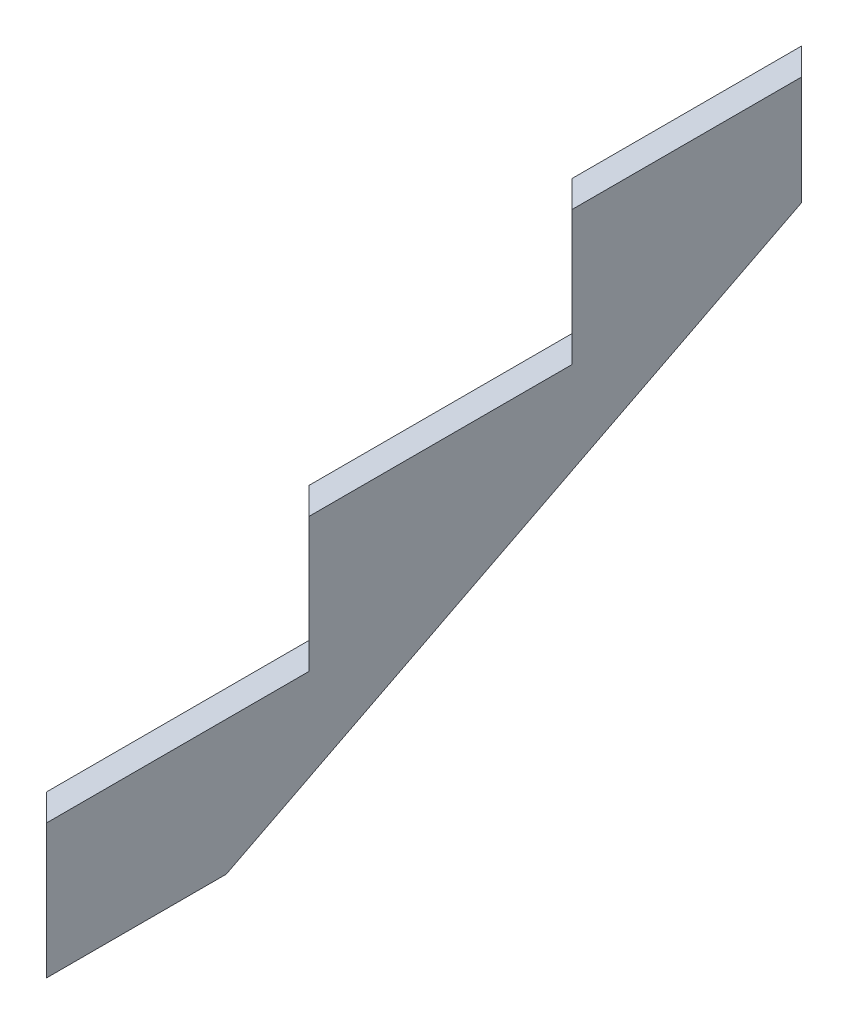
ISO-10303-21;
HEADER;
FILE_DESCRIPTION(('STEP AP214'),'2;1');
FILE_NAME('part.step','',(''),(''),'','','');
FILE_SCHEMA(('AUTOMOTIVE_DESIGN { 1 0 10303 214 1 1 1 1 }'));
ENDSEC;
DATA;
#1=APPLICATION_CONTEXT('core data for automotive mechanical design processes');
#2=APPLICATION_PROTOCOL_DEFINITION('international standard','automotive_design',2000,#1);
#3=PRODUCT_CONTEXT('',#1,'mechanical');
#4=PRODUCT('Part','Part','',(#3));
#5=PRODUCT_RELATED_PRODUCT_CATEGORY('part','',(#4));
#6=PRODUCT_DEFINITION_FORMATION('','',#4);
#7=PRODUCT_DEFINITION_CONTEXT('part definition',#1,'design');
#8=PRODUCT_DEFINITION('design','',#6,#7);
#9=PRODUCT_DEFINITION_SHAPE('','',#8);
#10=(LENGTH_UNIT() NAMED_UNIT(*) SI_UNIT(.MILLI.,.METRE.));
#11=(NAMED_UNIT(*) PLANE_ANGLE_UNIT() SI_UNIT($,.RADIAN.));
#12=(NAMED_UNIT(*) SI_UNIT($,.STERADIAN.) SOLID_ANGLE_UNIT());
#13=UNCERTAINTY_MEASURE_WITH_UNIT(LENGTH_MEASURE(1.E-05),#10,'distance_accuracy_value','');
#14=(GEOMETRIC_REPRESENTATION_CONTEXT(3) GLOBAL_UNCERTAINTY_ASSIGNED_CONTEXT((#13)) GLOBAL_UNIT_ASSIGNED_CONTEXT((#10,
#11,#12)) REPRESENTATION_CONTEXT('',''));
#15=CARTESIAN_POINT('',(0.,0.,0.));
#16=DIRECTION('',(0.,0.,1.));
#17=DIRECTION('',(1.,0.,0.));
#18=AXIS2_PLACEMENT_3D('',#15,#16,#17);
#19=CARTESIAN_POINT('',(38.1,0.,0.));
#20=DIRECTION('',(0.,1.,0.));
#21=DIRECTION('',(0.,0.,1.));
#22=AXIS2_PLACEMENT_3D('',#19,#20,#21);
#23=PLANE('',#22);
#24=DIRECTION('',(0.,0.,-1.));
#25=VECTOR('',#24,1.);
#26=CARTESIAN_POINT('',(38.1,0.,0.));
#27=LINE('',#26,#25);
#28=CARTESIAN_POINT('',(38.1,0.,0.));
#29=VERTEX_POINT('',#28);
#30=CARTESIAN_POINT('',(38.1,0.,-255.19928490216));
#31=VERTEX_POINT('',#30);
#32=EDGE_CURVE('E111',#29,#31,#27,.T.);
#33=ORIENTED_EDGE('',*,*,#32,.F.);
#34=DIRECTION('',(0.707106781186551,0.,0.707106781186544));
#35=VECTOR('',#34,1.);
#36=CARTESIAN_POINT('',(38.1,0.,0.));
#37=LINE('',#36,#35);
#38=CARTESIAN_POINT('',(0.,0.,-38.0999999999996));
#39=VERTEX_POINT('',#38);
#40=EDGE_CURVE('E107',#39,#29,#37,.T.);
#41=ORIENTED_EDGE('',*,*,#40,.F.);
#42=DIRECTION('',(0.,0.,-1.));
#43=VECTOR('',#42,1.);
#44=CARTESIAN_POINT('',(0.,0.,0.));
#45=LINE('',#44,#43);
#46=CARTESIAN_POINT('',(0.,0.,-255.19928490216));
#47=VERTEX_POINT('',#46);
#48=EDGE_CURVE('E128',#39,#47,#45,.T.);
#49=ORIENTED_EDGE('',*,*,#48,.T.);
#50=DIRECTION('',(-1.,0.,0.));
#51=VECTOR('',#50,1.);
#52=CARTESIAN_POINT('',(38.1,0.,-255.19928490216));
#53=LINE('',#52,#51);
#54=EDGE_CURVE('E11',#31,#47,#53,.T.);
#55=ORIENTED_EDGE('',*,*,#54,.F.);
#56=EDGE_LOOP('',(#33,#41,#49,#55));
#57=FACE_BOUND('',#56,.T.);
#58=ADVANCED_FACE('F35',(#57),#23,.F.);
#59=CARTESIAN_POINT('',(38.1,-103.395446885827,-52.8263162115477));
#60=DIRECTION('',(0.,0.890505333104577,0.454972803266642));
#61=DIRECTION('',(0.,-0.454972803266642,0.890505333104577));
#62=AXIS2_PLACEMENT_3D('',#59,#60,#61);
#63=PLANE('',#62);
#64=DIRECTION('',(0.,0.454972803266642,-0.890505333104577));
#65=VECTOR('',#64,1.);
#66=CARTESIAN_POINT('',(0.,-103.395446885827,-52.8263162115477));
#67=LINE('',#66,#65);
#68=CARTESIAN_POINT('',(0.,436.526629401535,-1109.6004463193));
#69=VERTEX_POINT('',#68);
#70=EDGE_CURVE('E130',#47,#69,#67,.T.);
#71=ORIENTED_EDGE('',*,*,#70,.T.);
#72=DIRECTION('',(-0.665037921925039,0.339778052268348,-0.665037921925024));
#73=VECTOR('',#72,1.);
#74=CARTESIAN_POINT('',(505.872214019945,178.068773225707,-603.728232299372));
#75=LINE('',#74,#73);
#76=CARTESIAN_POINT('',(38.0999999999998,417.060756306733,-1071.50044631931));
#77=VERTEX_POINT('',#76);
#78=EDGE_CURVE('E131',#77,#69,#75,.T.);
#79=ORIENTED_EDGE('',*,*,#78,.F.);
#80=DIRECTION('',(0.,0.454972803266642,-0.890505333104577));
#81=VECTOR('',#80,1.);
#82=CARTESIAN_POINT('',(38.1,-103.395446885827,-52.8263162115477));
#83=LINE('',#82,#81);
#84=EDGE_CURVE('E173',#31,#77,#83,.T.);
#85=ORIENTED_EDGE('',*,*,#84,.F.);
#86=ORIENTED_EDGE('',*,*,#54,.T.);
#87=EDGE_LOOP('',(#71,#79,#85,#86));
#88=FACE_BOUND('',#87,.T.);
#89=ADVANCED_FACE('F189',(#88),#63,.F.);
#90=CARTESIAN_POINT('',(38.1,571.5,0.));
#91=DIRECTION('',(0.,-1.,0.));
#92=DIRECTION('',(0.,0.,-1.));
#93=AXIS2_PLACEMENT_3D('',#90,#91,#92);
#94=PLANE('',#93);
#95=DIRECTION('',(0.,0.,1.));
#96=VECTOR('',#95,1.);
#97=CARTESIAN_POINT('',(0.,571.5,0.));
#98=LINE('',#97,#96);
#99=CARTESIAN_POINT('',(0.,571.5,-1109.6004463193));
#100=VERTEX_POINT('',#99);
#101=CARTESIAN_POINT('',(0.,571.5,-783.820468293582));
#102=VERTEX_POINT('',#101);
#103=EDGE_CURVE('E137',#100,#102,#98,.T.);
#104=ORIENTED_EDGE('',*,*,#103,.T.);
#105=DIRECTION('',(-0.707106781186551,0.,-0.707106781186544));
#106=VECTOR('',#105,1.);
#107=CARTESIAN_POINT('',(391.910234146791,571.5,-391.910234146795));
#108=LINE('',#107,#106);
#109=CARTESIAN_POINT('',(38.1,571.5,-745.720468293582));
#110=VERTEX_POINT('',#109);
#111=EDGE_CURVE('E162',#110,#102,#108,.T.);
#112=ORIENTED_EDGE('',*,*,#111,.F.);
#113=DIRECTION('',(0.,0.,1.));
#114=VECTOR('',#113,1.);
#115=CARTESIAN_POINT('',(38.1,571.5,0.));
#116=LINE('',#115,#114);
#117=CARTESIAN_POINT('',(38.1,571.5,-1071.50044631931));
#118=VERTEX_POINT('',#117);
#119=EDGE_CURVE('E176',#118,#110,#116,.T.);
#120=ORIENTED_EDGE('',*,*,#119,.F.);
#121=DIRECTION('',(0.707106781186556,0.,0.707106781186539));
#122=VECTOR('',#121,1.);
#123=CARTESIAN_POINT('',(554.800223159652,571.5,-554.800223159665));
#124=LINE('',#123,#122);
#125=EDGE_CURVE('E158',#100,#118,#124,.T.);
#126=ORIENTED_EDGE('',*,*,#125,.F.);
#127=EDGE_LOOP('',(#104,#112,#120,#126));
#128=FACE_BOUND('',#127,.T.);
#129=ADVANCED_FACE('F182',(#128),#94,.F.);
#130=CARTESIAN_POINT('',(38.1,381.,-1.13445986899117E-13));
#131=DIRECTION('',(0.,1.,0.));
#132=DIRECTION('',(0.,0.,1.));
#133=AXIS2_PLACEMENT_3D('',#130,#131,#132);
#134=PLANE('',#133);
#135=DIRECTION('',(-0.707106781186551,0.,-0.707106781186544));
#136=VECTOR('',#135,1.);
#137=CARTESIAN_POINT('',(38.1,381.,-372.860234146791));
#138=LINE('',#137,#136);
#139=CARTESIAN_POINT('',(38.1,381.,-372.860234146791));
#140=VERTEX_POINT('',#139);
#141=CARTESIAN_POINT('',(0.,381.,-410.960234146791));
#142=VERTEX_POINT('',#141);
#143=EDGE_CURVE('E193',#140,#142,#138,.T.);
#144=ORIENTED_EDGE('',*,*,#143,.F.);
#145=DIRECTION('',(0.,0.,-1.));
#146=VECTOR('',#145,1.);
#147=CARTESIAN_POINT('',(38.1,381.,-1.13445986899117E-13));
#148=LINE('',#147,#146);
#149=CARTESIAN_POINT('',(38.1,381.,-745.720468293583));
#150=VERTEX_POINT('',#149);
#151=EDGE_CURVE('E124',#140,#150,#148,.T.);
#152=ORIENTED_EDGE('',*,*,#151,.T.);
#153=DIRECTION('',(0.707106781186551,0.,0.707106781186544));
#154=VECTOR('',#153,1.);
#155=CARTESIAN_POINT('',(391.910234146791,381.,-391.910234146795));
#156=LINE('',#155,#154);
#157=CARTESIAN_POINT('',(0.,381.,-783.820468293582));
#158=VERTEX_POINT('',#157);
#159=EDGE_CURVE('E154',#158,#150,#156,.T.);
#160=ORIENTED_EDGE('',*,*,#159,.F.);
#161=DIRECTION('',(0.,0.,-1.));
#162=VECTOR('',#161,1.);
#163=CARTESIAN_POINT('',(0.,381.,-1.13445986899117E-13));
#164=LINE('',#163,#162);
#165=EDGE_CURVE('E140',#142,#158,#164,.T.);
#166=ORIENTED_EDGE('',*,*,#165,.F.);
#167=EDGE_LOOP('',(#144,#152,#160,#166));
#168=FACE_BOUND('',#167,.T.);
#169=ADVANCED_FACE('F155',(#168),#134,.T.);
#170=CARTESIAN_POINT('',(38.1,190.5,0.));
#171=DIRECTION('',(0.,1.,0.));
#172=DIRECTION('',(0.,0.,1.));
#173=AXIS2_PLACEMENT_3D('',#170,#171,#172);
#174=PLANE('',#173);
#175=DIRECTION('',(-0.707106781186551,0.,-0.707106781186544));
#176=VECTOR('',#175,1.);
#177=CARTESIAN_POINT('',(38.1,190.5,0.));
#178=LINE('',#177,#176);
#179=CARTESIAN_POINT('',(38.1,190.5,0.));
#180=VERTEX_POINT('',#179);
#181=CARTESIAN_POINT('',(0.,190.5,-38.0999999999996));
#182=VERTEX_POINT('',#181);
#183=EDGE_CURVE('E49',#180,#182,#178,.T.);
#184=ORIENTED_EDGE('',*,*,#183,.F.);
#185=DIRECTION('',(0.,0.,-1.));
#186=VECTOR('',#185,1.);
#187=CARTESIAN_POINT('',(38.1,190.5,0.));
#188=LINE('',#187,#186);
#189=CARTESIAN_POINT('',(38.1,190.5,-372.860234146791));
#190=VERTEX_POINT('',#189);
#191=EDGE_CURVE('E42',#180,#190,#188,.T.);
#192=ORIENTED_EDGE('',*,*,#191,.T.);
#193=DIRECTION('',(0.707106781186551,0.,0.707106781186544));
#194=VECTOR('',#193,1.);
#195=CARTESIAN_POINT('',(38.1,190.5,-372.860234146791));
#196=LINE('',#195,#194);
#197=CARTESIAN_POINT('',(0.,190.5,-410.960234146791));
#198=VERTEX_POINT('',#197);
#199=EDGE_CURVE('E164',#198,#190,#196,.T.);
#200=ORIENTED_EDGE('',*,*,#199,.F.);
#201=DIRECTION('',(0.,0.,-1.));
#202=VECTOR('',#201,1.);
#203=CARTESIAN_POINT('',(0.,190.5,0.));
#204=LINE('',#203,#202);
#205=EDGE_CURVE('E56',#182,#198,#204,.T.);
#206=ORIENTED_EDGE('',*,*,#205,.F.);
#207=EDGE_LOOP('',(#184,#192,#200,#206));
#208=FACE_BOUND('',#207,.T.);
#209=ADVANCED_FACE('F115',(#208),#174,.T.);
#210=CARTESIAN_POINT('',(38.1,0.,0.));
#211=DIRECTION('',(1.,0.,0.));
#212=DIRECTION('',(0.,0.,-1.));
#213=AXIS2_PLACEMENT_3D('',#210,#211,#212);
#214=PLANE('',#213);
#215=DIRECTION('',(0.,1.,0.));
#216=VECTOR('',#215,1.);
#217=CARTESIAN_POINT('',(38.1,369.599575789148,-1071.50044631931));
#218=LINE('',#217,#216);
#219=EDGE_CURVE('E169',#77,#118,#218,.T.);
#220=ORIENTED_EDGE('',*,*,#219,.T.);
#221=ORIENTED_EDGE('',*,*,#119,.T.);
#222=DIRECTION('',(0.,1.,0.));
#223=VECTOR('',#222,1.);
#224=CARTESIAN_POINT('',(38.1,4.34601592563669E-13,-745.720468293583));
#225=LINE('',#224,#223);
#226=EDGE_CURVE('E179',#150,#110,#225,.T.);
#227=ORIENTED_EDGE('',*,*,#226,.F.);
#228=ORIENTED_EDGE('',*,*,#151,.F.);
#229=DIRECTION('',(0.,1.,0.));
#230=VECTOR('',#229,1.);
#231=CARTESIAN_POINT('',(38.1,0.,-372.860234146791));
#232=LINE('',#231,#230);
#233=EDGE_CURVE('E122',#190,#140,#232,.T.);
#234=ORIENTED_EDGE('',*,*,#233,.F.);
#235=ORIENTED_EDGE('',*,*,#191,.F.);
#236=DIRECTION('',(0.,1.,0.));
#237=VECTOR('',#236,1.);
#238=CARTESIAN_POINT('',(38.1,0.,0.));
#239=LINE('',#238,#237);
#240=EDGE_CURVE('E104',#29,#180,#239,.T.);
#241=ORIENTED_EDGE('',*,*,#240,.F.);
#242=ORIENTED_EDGE('',*,*,#32,.T.);
#243=ORIENTED_EDGE('',*,*,#84,.T.);
#244=EDGE_LOOP('',(#220,#221,#227,#228,#234,#235,#241,#242,#243));
#245=FACE_BOUND('',#244,.T.);
#246=ADVANCED_FACE('F120',(#245),#214,.T.);
#247=CARTESIAN_POINT('',(0.,0.,0.));
#248=DIRECTION('',(1.,0.,0.));
#249=DIRECTION('',(0.,0.,-1.));
#250=AXIS2_PLACEMENT_3D('',#247,#248,#249);
#251=PLANE('',#250);
#252=ORIENTED_EDGE('',*,*,#48,.F.);
#253=DIRECTION('',(0.,1.,0.));
#254=VECTOR('',#253,1.);
#255=CARTESIAN_POINT('',(0.,-53.8815367264146,-38.0999999999996));
#256=LINE('',#255,#254);
#257=EDGE_CURVE('E116',#39,#182,#256,.T.);
#258=ORIENTED_EDGE('',*,*,#257,.T.);
#259=ORIENTED_EDGE('',*,*,#205,.T.);
#260=DIRECTION('',(0.,1.,0.));
#261=VECTOR('',#260,1.);
#262=CARTESIAN_POINT('',(0.,136.618463273585,-410.960234146791));
#263=LINE('',#262,#261);
#264=EDGE_CURVE('E150',#198,#142,#263,.T.);
#265=ORIENTED_EDGE('',*,*,#264,.T.);
#266=ORIENTED_EDGE('',*,*,#165,.T.);
#267=DIRECTION('',(0.,1.,0.));
#268=VECTOR('',#267,1.);
#269=CARTESIAN_POINT('',(0.,327.118463273585,-783.820468293582));
#270=LINE('',#269,#268);
#271=EDGE_CURVE('E148',#158,#102,#270,.T.);
#272=ORIENTED_EDGE('',*,*,#271,.T.);
#273=ORIENTED_EDGE('',*,*,#103,.F.);
#274=DIRECTION('',(0.,-1.,0.));
#275=VECTOR('',#274,1.);
#276=CARTESIAN_POINT('',(0.,0.,-1109.6004463193));
#277=LINE('',#276,#275);
#278=EDGE_CURVE('E134',#100,#69,#277,.T.);
#279=ORIENTED_EDGE('',*,*,#278,.T.);
#280=ORIENTED_EDGE('',*,*,#70,.F.);
#281=EDGE_LOOP('',(#252,#258,#259,#265,#266,#272,#273,#279,#280));
#282=FACE_BOUND('',#281,.T.);
#283=ADVANCED_FACE('F145',(#282),#251,.F.);
#284=CARTESIAN_POINT('',(554.800223159652,369.599575789148,-554.800223159665));
#285=DIRECTION('',(-0.70710678118654,0.,0.707106781186556));
#286=DIRECTION('',(0.707106781186556,0.,0.707106781186539));
#287=AXIS2_PLACEMENT_3D('',#284,#285,#286);
#288=PLANE('',#287);
#289=ORIENTED_EDGE('',*,*,#78,.T.);
#290=ORIENTED_EDGE('',*,*,#278,.F.);
#291=ORIENTED_EDGE('',*,*,#125,.T.);
#292=ORIENTED_EDGE('',*,*,#219,.F.);
#293=EDGE_LOOP('',(#289,#290,#291,#292));
#294=FACE_BOUND('',#293,.T.);
#295=ADVANCED_FACE('F187',(#294),#288,.F.);
#296=CARTESIAN_POINT('',(391.910234146791,327.118463273585,-391.910234146795));
#297=DIRECTION('',(0.707106781186544,0.,-0.707106781186551));
#298=DIRECTION('',(-0.707106781186551,0.,-0.707106781186544));
#299=AXIS2_PLACEMENT_3D('',#296,#297,#298);
#300=PLANE('',#299);
#301=ORIENTED_EDGE('',*,*,#159,.T.);
#302=ORIENTED_EDGE('',*,*,#226,.T.);
#303=ORIENTED_EDGE('',*,*,#111,.T.);
#304=ORIENTED_EDGE('',*,*,#271,.F.);
#305=EDGE_LOOP('',(#301,#302,#303,#304));
#306=FACE_BOUND('',#305,.T.);
#307=ADVANCED_FACE('F160',(#306),#300,.F.);
#308=CARTESIAN_POINT('',(38.1,136.618463273585,-372.860234146791));
#309=DIRECTION('',(0.707106781186544,0.,-0.707106781186551));
#310=DIRECTION('',(-0.707106781186551,0.,-0.707106781186544));
#311=AXIS2_PLACEMENT_3D('',#308,#309,#310);
#312=PLANE('',#311);
#313=ORIENTED_EDGE('',*,*,#199,.T.);
#314=ORIENTED_EDGE('',*,*,#233,.T.);
#315=ORIENTED_EDGE('',*,*,#143,.T.);
#316=ORIENTED_EDGE('',*,*,#264,.F.);
#317=EDGE_LOOP('',(#313,#314,#315,#316));
#318=FACE_BOUND('',#317,.T.);
#319=ADVANCED_FACE('F199',(#318),#312,.F.);
#320=CARTESIAN_POINT('',(38.1,-53.8815367264146,0.));
#321=DIRECTION('',(0.707106781186544,0.,-0.707106781186551));
#322=DIRECTION('',(-0.707106781186551,0.,-0.707106781186544));
#323=AXIS2_PLACEMENT_3D('',#320,#321,#322);
#324=PLANE('',#323);
#325=ORIENTED_EDGE('',*,*,#40,.T.);
#326=ORIENTED_EDGE('',*,*,#240,.T.);
#327=ORIENTED_EDGE('',*,*,#183,.T.);
#328=ORIENTED_EDGE('',*,*,#257,.F.);
#329=EDGE_LOOP('',(#325,#326,#327,#328));
#330=FACE_BOUND('',#329,.T.);
#331=ADVANCED_FACE('F105',(#330),#324,.F.);
#332=CLOSED_SHELL('',(#58,#89,#129,#169,#209,#246,#283,#295,#307,#319,#331));
#333=MANIFOLD_SOLID_BREP('B2',#332);
#334=ADVANCED_BREP_SHAPE_REPRESENTATION('',(#18,#333),#14);
#335=SHAPE_DEFINITION_REPRESENTATION(#9,#334);
ENDSEC;
END-ISO-10303-21;
